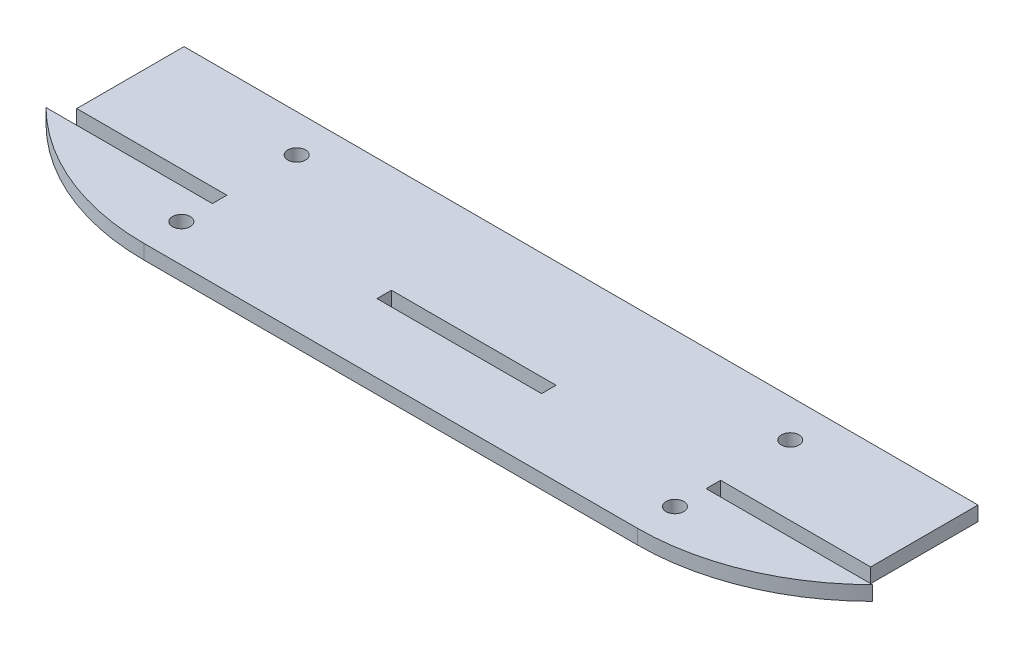
ISO-10303-21;
HEADER;
FILE_DESCRIPTION(('STEP AP214'),'2;1');
FILE_NAME('part.step','',(''),(''),'','','');
FILE_SCHEMA(('AUTOMOTIVE_DESIGN { 1 0 10303 214 1 1 1 1 }'));
ENDSEC;
DATA;
#1=APPLICATION_CONTEXT('core data for automotive mechanical design processes');
#2=APPLICATION_PROTOCOL_DEFINITION('international standard','automotive_design',2000,#1);
#3=PRODUCT_CONTEXT('',#1,'mechanical');
#4=PRODUCT('Part','Part','',(#3));
#5=PRODUCT_RELATED_PRODUCT_CATEGORY('part','',(#4));
#6=PRODUCT_DEFINITION_FORMATION('','',#4);
#7=PRODUCT_DEFINITION_CONTEXT('part definition',#1,'design');
#8=PRODUCT_DEFINITION('design','',#6,#7);
#9=PRODUCT_DEFINITION_SHAPE('','',#8);
#10=(LENGTH_UNIT() NAMED_UNIT(*) SI_UNIT(.MILLI.,.METRE.));
#11=(NAMED_UNIT(*) PLANE_ANGLE_UNIT() SI_UNIT($,.RADIAN.));
#12=(NAMED_UNIT(*) SI_UNIT($,.STERADIAN.) SOLID_ANGLE_UNIT());
#13=UNCERTAINTY_MEASURE_WITH_UNIT(LENGTH_MEASURE(1.E-05),#10,'distance_accuracy_value','');
#14=(GEOMETRIC_REPRESENTATION_CONTEXT(3) GLOBAL_UNCERTAINTY_ASSIGNED_CONTEXT((#13)) GLOBAL_UNIT_ASSIGNED_CONTEXT((#10,
#11,#12)) REPRESENTATION_CONTEXT('',''));
#15=CARTESIAN_POINT('',(0.,0.,0.));
#16=DIRECTION('',(0.,0.,1.));
#17=DIRECTION('',(1.,0.,0.));
#18=AXIS2_PLACEMENT_3D('',#15,#16,#17);
#19=CARTESIAN_POINT('',(-46.,2.7,-44.));
#20=DIRECTION('',(0.,1.,0.));
#21=DIRECTION('',(0.,0.,1.));
#22=AXIS2_PLACEMENT_3D('',#19,#20,#21);
#23=PLANE('',#22);
#24=CARTESIAN_POINT('',(-46.,2.7,-7.));
#25=DIRECTION('',(0.,1.,0.));
#26=DIRECTION('',(0.,0.,1.));
#27=AXIS2_PLACEMENT_3D('',#24,#25,#26);
#28=CIRCLE('',#27,1.65);
#29=CARTESIAN_POINT('',(-46.,2.7,-5.35));
#30=VERTEX_POINT('',#29);
#31=EDGE_CURVE('E531',#30,#30,#28,.T.);
#32=ORIENTED_EDGE('',*,*,#31,.F.);
#33=EDGE_LOOP('',(#32));
#34=FACE_BOUND('',#33,.T.);
#35=DIRECTION('',(0.,0.,1.));
#36=VECTOR('',#35,1.);
#37=CARTESIAN_POINT('',(-15.34,2.7,-15.5));
#38=LINE('',#37,#36);
#39=CARTESIAN_POINT('',(-15.34,2.7,-15.5));
#40=VERTEX_POINT('',#39);
#41=CARTESIAN_POINT('',(-15.34,2.7,-12.8));
#42=VERTEX_POINT('',#41);
#43=EDGE_CURVE('E153',#40,#42,#38,.T.);
#44=ORIENTED_EDGE('',*,*,#43,.F.);
#45=DIRECTION('',(-1.,0.,0.));
#46=VECTOR('',#45,1.);
#47=CARTESIAN_POINT('',(15.34,2.7,-15.5));
#48=LINE('',#47,#46);
#49=CARTESIAN_POINT('',(15.34,2.7,-15.5));
#50=VERTEX_POINT('',#49);
#51=EDGE_CURVE('E145',#50,#40,#48,.T.);
#52=ORIENTED_EDGE('',*,*,#51,.F.);
#53=DIRECTION('',(0.,0.,-1.));
#54=VECTOR('',#53,1.);
#55=CARTESIAN_POINT('',(15.34,2.7,-12.8));
#56=LINE('',#55,#54);
#57=CARTESIAN_POINT('',(15.34,2.7,-12.8));
#58=VERTEX_POINT('',#57);
#59=EDGE_CURVE('E168',#58,#50,#56,.T.);
#60=ORIENTED_EDGE('',*,*,#59,.F.);
#61=DIRECTION('',(1.,0.,0.));
#62=VECTOR('',#61,1.);
#63=CARTESIAN_POINT('',(-15.34,2.7,-12.8));
#64=LINE('',#63,#62);
#65=EDGE_CURVE('E166',#42,#58,#64,.T.);
#66=ORIENTED_EDGE('',*,*,#65,.F.);
#67=EDGE_LOOP('',(#44,#52,#60,#66));
#68=FACE_BOUND('',#67,.T.);
#69=CARTESIAN_POINT('',(46.,2.7,-28.5));
#70=DIRECTION('',(0.,1.,0.));
#71=DIRECTION('',(0.,0.,1.));
#72=AXIS2_PLACEMENT_3D('',#69,#70,#71);
#73=CIRCLE('',#72,1.65);
#74=CARTESIAN_POINT('',(46.,2.7,-26.85));
#75=VERTEX_POINT('',#74);
#76=EDGE_CURVE('E184',#75,#75,#73,.T.);
#77=ORIENTED_EDGE('',*,*,#76,.F.);
#78=EDGE_LOOP('',(#77));
#79=FACE_BOUND('',#78,.T.);
#80=DIRECTION('',(-1.,0.,0.));
#81=VECTOR('',#80,1.);
#82=CARTESIAN_POINT('',(-46.0151510874645,2.7,-12.8));
#83=LINE('',#82,#81);
#84=CARTESIAN_POINT('',(-46.0151510874645,2.7,-12.8));
#85=VERTEX_POINT('',#84);
#86=CARTESIAN_POINT('',(-77.0251510874645,2.7,-12.8));
#87=VERTEX_POINT('',#86);
#88=EDGE_CURVE('E190',#85,#87,#83,.T.);
#89=ORIENTED_EDGE('',*,*,#88,.T.);
#90=CARTESIAN_POINT('',(-46.,2.7,-44.));
#91=DIRECTION('',(0.,1.,0.));
#92=DIRECTION('',(0.,0.,1.));
#93=AXIS2_PLACEMENT_3D('',#90,#91,#92);
#94=CIRCLE('',#93,44.);
#95=CARTESIAN_POINT('',(-46.,2.7,0.));
#96=VERTEX_POINT('',#95);
#97=EDGE_CURVE('E193',#87,#96,#94,.T.);
#98=ORIENTED_EDGE('',*,*,#97,.T.);
#99=DIRECTION('',(1.,0.,0.));
#100=VECTOR('',#99,1.);
#101=CARTESIAN_POINT('',(-46.,2.7,0.));
#102=LINE('',#101,#100);
#103=CARTESIAN_POINT('',(46.,2.7,0.));
#104=VERTEX_POINT('',#103);
#105=EDGE_CURVE('E196',#96,#104,#102,.T.);
#106=ORIENTED_EDGE('',*,*,#105,.T.);
#107=CARTESIAN_POINT('',(46.,2.7,-44.));
#108=DIRECTION('',(0.,1.,0.));
#109=DIRECTION('',(0.,0.,1.));
#110=AXIS2_PLACEMENT_3D('',#107,#108,#109);
#111=CIRCLE('',#110,44.);
#112=CARTESIAN_POINT('',(77.0251510874645,2.7,-12.8));
#113=VERTEX_POINT('',#112);
#114=EDGE_CURVE('E198',#104,#113,#111,.T.);
#115=ORIENTED_EDGE('',*,*,#114,.T.);
#116=DIRECTION('',(-1.,0.,0.));
#117=VECTOR('',#116,1.);
#118=CARTESIAN_POINT('',(77.0251510874645,2.7,-12.8));
#119=LINE('',#118,#117);
#120=CARTESIAN_POINT('',(46.0151510874645,2.7,-12.8));
#121=VERTEX_POINT('',#120);
#122=EDGE_CURVE('E200',#113,#121,#119,.T.);
#123=ORIENTED_EDGE('',*,*,#122,.T.);
#124=DIRECTION('',(0.,0.,-1.));
#125=VECTOR('',#124,1.);
#126=CARTESIAN_POINT('',(46.0151510874645,2.7,-15.5));
#127=LINE('',#126,#125);
#128=CARTESIAN_POINT('',(46.0151510874645,2.7,-15.5));
#129=VERTEX_POINT('',#128);
#130=EDGE_CURVE('E202',#121,#129,#127,.T.);
#131=ORIENTED_EDGE('',*,*,#130,.T.);
#132=DIRECTION('',(1.,0.,0.));
#133=VECTOR('',#132,1.);
#134=CARTESIAN_POINT('',(46.0151510874645,2.7,-15.5));
#135=LINE('',#134,#133);
#136=CARTESIAN_POINT('',(73.9951510874645,2.7,-15.5));
#137=VERTEX_POINT('',#136);
#138=EDGE_CURVE('E204',#129,#137,#135,.T.);
#139=ORIENTED_EDGE('',*,*,#138,.T.);
#140=DIRECTION('',(0.,0.,-1.));
#141=VECTOR('',#140,1.);
#142=CARTESIAN_POINT('',(73.9951510874645,2.7,-35.5));
#143=LINE('',#142,#141);
#144=CARTESIAN_POINT('',(73.9951510874645,2.7,-35.5));
#145=VERTEX_POINT('',#144);
#146=EDGE_CURVE('E206',#137,#145,#143,.T.);
#147=ORIENTED_EDGE('',*,*,#146,.T.);
#148=DIRECTION('',(-1.,0.,0.));
#149=VECTOR('',#148,1.);
#150=CARTESIAN_POINT('',(-73.9951510874645,2.7,-35.5));
#151=LINE('',#150,#149);
#152=CARTESIAN_POINT('',(-73.9951510874645,2.7,-35.5));
#153=VERTEX_POINT('',#152);
#154=EDGE_CURVE('E208',#145,#153,#151,.T.);
#155=ORIENTED_EDGE('',*,*,#154,.T.);
#156=DIRECTION('',(0.,0.,1.));
#157=VECTOR('',#156,1.);
#158=CARTESIAN_POINT('',(-73.9951510874645,2.7,-35.5));
#159=LINE('',#158,#157);
#160=CARTESIAN_POINT('',(-73.9951510874645,2.7,-15.5));
#161=VERTEX_POINT('',#160);
#162=EDGE_CURVE('E210',#153,#161,#159,.T.);
#163=ORIENTED_EDGE('',*,*,#162,.T.);
#164=DIRECTION('',(1.,0.,0.));
#165=VECTOR('',#164,1.);
#166=CARTESIAN_POINT('',(-46.0151510874645,2.7,-15.5));
#167=LINE('',#166,#165);
#168=CARTESIAN_POINT('',(-46.0151510874645,2.7,-15.5));
#169=VERTEX_POINT('',#168);
#170=EDGE_CURVE('E212',#161,#169,#167,.T.);
#171=ORIENTED_EDGE('',*,*,#170,.T.);
#172=DIRECTION('',(0.,0.,1.));
#173=VECTOR('',#172,1.);
#174=CARTESIAN_POINT('',(-46.0151510874645,2.7,-15.5));
#175=LINE('',#174,#173);
#176=EDGE_CURVE('E214',#169,#85,#175,.T.);
#177=ORIENTED_EDGE('',*,*,#176,.T.);
#178=EDGE_LOOP('',(#89,#98,#106,#115,#123,#131,#139,#147,#155,#163,#171,#177));
#179=FACE_BOUND('',#178,.T.);
#180=CARTESIAN_POINT('',(46.,2.7,-7.));
#181=DIRECTION('',(0.,1.,0.));
#182=DIRECTION('',(0.,0.,1.));
#183=AXIS2_PLACEMENT_3D('',#180,#181,#182);
#184=CIRCLE('',#183,1.65);
#185=CARTESIAN_POINT('',(46.,2.7,-5.35));
#186=VERTEX_POINT('',#185);
#187=EDGE_CURVE('E174',#186,#186,#184,.T.);
#188=ORIENTED_EDGE('',*,*,#187,.F.);
#189=EDGE_LOOP('',(#188));
#190=FACE_BOUND('',#189,.T.);
#191=CARTESIAN_POINT('',(-46.,2.7,-28.5));
#192=DIRECTION('',(0.,1.,0.));
#193=DIRECTION('',(0.,0.,1.));
#194=AXIS2_PLACEMENT_3D('',#191,#192,#193);
#195=CIRCLE('',#194,1.65);
#196=CARTESIAN_POINT('',(-46.,2.7,-26.85));
#197=VERTEX_POINT('',#196);
#198=EDGE_CURVE('E522',#197,#197,#195,.T.);
#199=ORIENTED_EDGE('',*,*,#198,.F.);
#200=EDGE_LOOP('',(#199));
#201=FACE_BOUND('',#200,.T.);
#202=ADVANCED_FACE('F32',(#34,#68,#79,#179,#190,#201),#23,.T.);
#203=CARTESIAN_POINT('',(-46.,0.,-44.));
#204=DIRECTION('',(0.,1.,0.));
#205=DIRECTION('',(0.,0.,1.));
#206=AXIS2_PLACEMENT_3D('',#203,#204,#205);
#207=PLANE('',#206);
#208=CARTESIAN_POINT('',(46.,0.,-28.5));
#209=DIRECTION('',(0.,1.,0.));
#210=DIRECTION('',(0.,0.,1.));
#211=AXIS2_PLACEMENT_3D('',#208,#209,#210);
#212=CIRCLE('',#211,1.65);
#213=CARTESIAN_POINT('',(46.,0.,-26.85));
#214=VERTEX_POINT('',#213);
#215=EDGE_CURVE('E161',#214,#214,#212,.T.);
#216=ORIENTED_EDGE('',*,*,#215,.T.);
#217=EDGE_LOOP('',(#216));
#218=FACE_BOUND('',#217,.T.);
#219=DIRECTION('',(-1.,0.,0.));
#220=VECTOR('',#219,1.);
#221=CARTESIAN_POINT('',(-46.0151510874645,0.,-12.8));
#222=LINE('',#221,#220);
#223=CARTESIAN_POINT('',(-46.0151510874645,0.,-12.8));
#224=VERTEX_POINT('',#223);
#225=CARTESIAN_POINT('',(-77.0251510874645,0.,-12.8));
#226=VERTEX_POINT('',#225);
#227=EDGE_CURVE('E187',#224,#226,#222,.T.);
#228=ORIENTED_EDGE('',*,*,#227,.F.);
#229=DIRECTION('',(0.,0.,1.));
#230=VECTOR('',#229,1.);
#231=CARTESIAN_POINT('',(-46.0151510874645,0.,-15.5));
#232=LINE('',#231,#230);
#233=CARTESIAN_POINT('',(-46.0151510874645,0.,-15.5));
#234=VERTEX_POINT('',#233);
#235=EDGE_CURVE('E194',#234,#224,#232,.T.);
#236=ORIENTED_EDGE('',*,*,#235,.F.);
#237=DIRECTION('',(1.,0.,0.));
#238=VECTOR('',#237,1.);
#239=CARTESIAN_POINT('',(-46.0151510874645,0.,-15.5));
#240=LINE('',#239,#238);
#241=CARTESIAN_POINT('',(-73.9951510874645,0.,-15.5));
#242=VERTEX_POINT('',#241);
#243=EDGE_CURVE('E237',#242,#234,#240,.T.);
#244=ORIENTED_EDGE('',*,*,#243,.F.);
#245=DIRECTION('',(0.,0.,1.));
#246=VECTOR('',#245,1.);
#247=CARTESIAN_POINT('',(-73.9951510874645,0.,-35.5));
#248=LINE('',#247,#246);
#249=CARTESIAN_POINT('',(-73.9951510874645,0.,-35.5));
#250=VERTEX_POINT('',#249);
#251=EDGE_CURVE('E235',#250,#242,#248,.T.);
#252=ORIENTED_EDGE('',*,*,#251,.F.);
#253=DIRECTION('',(-1.,0.,0.));
#254=VECTOR('',#253,1.);
#255=CARTESIAN_POINT('',(-73.9951510874645,0.,-35.5));
#256=LINE('',#255,#254);
#257=CARTESIAN_POINT('',(73.9951510874645,0.,-35.5));
#258=VERTEX_POINT('',#257);
#259=EDGE_CURVE('E233',#258,#250,#256,.T.);
#260=ORIENTED_EDGE('',*,*,#259,.F.);
#261=DIRECTION('',(0.,0.,-1.));
#262=VECTOR('',#261,1.);
#263=CARTESIAN_POINT('',(73.9951510874645,0.,-35.5));
#264=LINE('',#263,#262);
#265=CARTESIAN_POINT('',(73.9951510874645,0.,-15.5));
#266=VERTEX_POINT('',#265);
#267=EDGE_CURVE('E231',#266,#258,#264,.T.);
#268=ORIENTED_EDGE('',*,*,#267,.F.);
#269=DIRECTION('',(1.,0.,0.));
#270=VECTOR('',#269,1.);
#271=CARTESIAN_POINT('',(46.0151510874645,0.,-15.5));
#272=LINE('',#271,#270);
#273=CARTESIAN_POINT('',(46.0151510874645,0.,-15.5));
#274=VERTEX_POINT('',#273);
#275=EDGE_CURVE('E229',#274,#266,#272,.T.);
#276=ORIENTED_EDGE('',*,*,#275,.F.);
#277=DIRECTION('',(0.,0.,-1.));
#278=VECTOR('',#277,1.);
#279=CARTESIAN_POINT('',(46.0151510874645,0.,-15.5));
#280=LINE('',#279,#278);
#281=CARTESIAN_POINT('',(46.0151510874645,0.,-12.8));
#282=VERTEX_POINT('',#281);
#283=EDGE_CURVE('E227',#282,#274,#280,.T.);
#284=ORIENTED_EDGE('',*,*,#283,.F.);
#285=DIRECTION('',(-1.,0.,0.));
#286=VECTOR('',#285,1.);
#287=CARTESIAN_POINT('',(77.0251510874645,0.,-12.8));
#288=LINE('',#287,#286);
#289=CARTESIAN_POINT('',(77.0251510874645,0.,-12.8));
#290=VERTEX_POINT('',#289);
#291=EDGE_CURVE('E225',#290,#282,#288,.T.);
#292=ORIENTED_EDGE('',*,*,#291,.F.);
#293=CARTESIAN_POINT('',(46.,0.,-44.));
#294=DIRECTION('',(0.,1.,0.));
#295=DIRECTION('',(0.,0.,1.));
#296=AXIS2_PLACEMENT_3D('',#293,#294,#295);
#297=CIRCLE('',#296,44.);
#298=CARTESIAN_POINT('',(46.,0.,0.));
#299=VERTEX_POINT('',#298);
#300=EDGE_CURVE('E223',#299,#290,#297,.T.);
#301=ORIENTED_EDGE('',*,*,#300,.F.);
#302=DIRECTION('',(1.,0.,0.));
#303=VECTOR('',#302,1.);
#304=CARTESIAN_POINT('',(-46.,0.,0.));
#305=LINE('',#304,#303);
#306=CARTESIAN_POINT('',(-46.,0.,0.));
#307=VERTEX_POINT('',#306);
#308=EDGE_CURVE('E221',#307,#299,#305,.T.);
#309=ORIENTED_EDGE('',*,*,#308,.F.);
#310=CARTESIAN_POINT('',(-46.,0.,-44.));
#311=DIRECTION('',(0.,1.,0.));
#312=DIRECTION('',(0.,0.,1.));
#313=AXIS2_PLACEMENT_3D('',#310,#311,#312);
#314=CIRCLE('',#313,44.);
#315=EDGE_CURVE('E219',#226,#307,#314,.T.);
#316=ORIENTED_EDGE('',*,*,#315,.F.);
#317=EDGE_LOOP('',(#228,#236,#244,#252,#260,#268,#276,#284,#292,#301,#309,#316));
#318=FACE_BOUND('',#317,.T.);
#319=DIRECTION('',(-1.,0.,0.));
#320=VECTOR('',#319,1.);
#321=CARTESIAN_POINT('',(15.34,0.,-15.5));
#322=LINE('',#321,#320);
#323=CARTESIAN_POINT('',(15.34,0.,-15.5));
#324=VERTEX_POINT('',#323);
#325=CARTESIAN_POINT('',(-15.34,0.,-15.5));
#326=VERTEX_POINT('',#325);
#327=EDGE_CURVE('E55',#324,#326,#322,.T.);
#328=ORIENTED_EDGE('',*,*,#327,.T.);
#329=DIRECTION('',(0.,0.,1.));
#330=VECTOR('',#329,1.);
#331=CARTESIAN_POINT('',(-15.34,0.,-15.5));
#332=LINE('',#331,#330);
#333=CARTESIAN_POINT('',(-15.34,0.,-12.8));
#334=VERTEX_POINT('',#333);
#335=EDGE_CURVE('E160',#326,#334,#332,.T.);
#336=ORIENTED_EDGE('',*,*,#335,.T.);
#337=DIRECTION('',(1.,0.,0.));
#338=VECTOR('',#337,1.);
#339=CARTESIAN_POINT('',(-15.34,0.,-12.8));
#340=LINE('',#339,#338);
#341=CARTESIAN_POINT('',(15.34,0.,-12.8));
#342=VERTEX_POINT('',#341);
#343=EDGE_CURVE('E176',#334,#342,#340,.T.);
#344=ORIENTED_EDGE('',*,*,#343,.T.);
#345=DIRECTION('',(0.,0.,-1.));
#346=VECTOR('',#345,1.);
#347=CARTESIAN_POINT('',(15.34,0.,-12.8));
#348=LINE('',#347,#346);
#349=EDGE_CURVE('E154',#342,#324,#348,.T.);
#350=ORIENTED_EDGE('',*,*,#349,.T.);
#351=EDGE_LOOP('',(#328,#336,#344,#350));
#352=FACE_BOUND('',#351,.T.);
#353=CARTESIAN_POINT('',(46.,0.,-7.));
#354=DIRECTION('',(0.,1.,0.));
#355=DIRECTION('',(0.,0.,1.));
#356=AXIS2_PLACEMENT_3D('',#353,#354,#355);
#357=CIRCLE('',#356,1.65);
#358=CARTESIAN_POINT('',(46.,0.,-5.35));
#359=VERTEX_POINT('',#358);
#360=EDGE_CURVE('E534',#359,#359,#357,.T.);
#361=ORIENTED_EDGE('',*,*,#360,.T.);
#362=EDGE_LOOP('',(#361));
#363=FACE_BOUND('',#362,.T.);
#364=CARTESIAN_POINT('',(-46.,0.,-7.));
#365=DIRECTION('',(0.,1.,0.));
#366=DIRECTION('',(0.,0.,1.));
#367=AXIS2_PLACEMENT_3D('',#364,#365,#366);
#368=CIRCLE('',#367,1.65);
#369=CARTESIAN_POINT('',(-46.,0.,-5.35));
#370=VERTEX_POINT('',#369);
#371=EDGE_CURVE('E528',#370,#370,#368,.T.);
#372=ORIENTED_EDGE('',*,*,#371,.T.);
#373=EDGE_LOOP('',(#372));
#374=FACE_BOUND('',#373,.T.);
#375=CARTESIAN_POINT('',(-46.,0.,-28.5));
#376=DIRECTION('',(0.,1.,0.));
#377=DIRECTION('',(0.,0.,1.));
#378=AXIS2_PLACEMENT_3D('',#375,#376,#377);
#379=CIRCLE('',#378,1.65);
#380=CARTESIAN_POINT('',(-46.,0.,-26.85));
#381=VERTEX_POINT('',#380);
#382=EDGE_CURVE('E525',#381,#381,#379,.T.);
#383=ORIENTED_EDGE('',*,*,#382,.T.);
#384=EDGE_LOOP('',(#383));
#385=FACE_BOUND('',#384,.T.);
#386=ADVANCED_FACE('F279',(#218,#318,#352,#363,#374,#385),#207,.F.);
#387=CARTESIAN_POINT('',(-46.0151510874645,2.7,-12.8));
#388=DIRECTION('',(0.,0.,1.));
#389=DIRECTION('',(1.,0.,0.));
#390=AXIS2_PLACEMENT_3D('',#387,#388,#389);
#391=PLANE('',#390);
#392=ORIENTED_EDGE('',*,*,#227,.T.);
#393=DIRECTION('',(0.,-1.,0.));
#394=VECTOR('',#393,1.);
#395=CARTESIAN_POINT('',(-77.0251510874645,2.7,-12.8));
#396=LINE('',#395,#394);
#397=EDGE_CURVE('E11',#87,#226,#396,.T.);
#398=ORIENTED_EDGE('',*,*,#397,.F.);
#399=ORIENTED_EDGE('',*,*,#88,.F.);
#400=DIRECTION('',(0.,-1.,0.));
#401=VECTOR('',#400,1.);
#402=CARTESIAN_POINT('',(-46.0151510874645,2.7,-12.8));
#403=LINE('',#402,#401);
#404=EDGE_CURVE('E216',#85,#224,#403,.T.);
#405=ORIENTED_EDGE('',*,*,#404,.T.);
#406=EDGE_LOOP('',(#392,#398,#399,#405));
#407=FACE_BOUND('',#406,.T.);
#408=ADVANCED_FACE('F34',(#407),#391,.F.);
#409=CARTESIAN_POINT('',(-46.,2.7,-44.));
#410=DIRECTION('',(0.,-1.,0.));
#411=DIRECTION('',(0.,0.,-1.));
#412=AXIS2_PLACEMENT_3D('',#409,#410,#411);
#413=CYLINDRICAL_SURFACE('',#412,44.);
#414=ORIENTED_EDGE('',*,*,#315,.T.);
#415=DIRECTION('',(0.,-1.,0.));
#416=VECTOR('',#415,1.);
#417=CARTESIAN_POINT('',(-46.,2.7,0.));
#418=LINE('',#417,#416);
#419=EDGE_CURVE('E40',#96,#307,#418,.T.);
#420=ORIENTED_EDGE('',*,*,#419,.F.);
#421=ORIENTED_EDGE('',*,*,#97,.F.);
#422=ORIENTED_EDGE('',*,*,#397,.T.);
#423=EDGE_LOOP('',(#414,#420,#421,#422));
#424=FACE_BOUND('',#423,.T.);
#425=ADVANCED_FACE('F297',(#424),#413,.T.);
#426=CARTESIAN_POINT('',(-46.,2.7,0.));
#427=DIRECTION('',(0.,0.,-1.));
#428=DIRECTION('',(-1.,0.,0.));
#429=AXIS2_PLACEMENT_3D('',#426,#427,#428);
#430=PLANE('',#429);
#431=ORIENTED_EDGE('',*,*,#308,.T.);
#432=DIRECTION('',(0.,-1.,0.));
#433=VECTOR('',#432,1.);
#434=CARTESIAN_POINT('',(46.,2.7,0.));
#435=LINE('',#434,#433);
#436=EDGE_CURVE('E266',#104,#299,#435,.T.);
#437=ORIENTED_EDGE('',*,*,#436,.F.);
#438=ORIENTED_EDGE('',*,*,#105,.F.);
#439=ORIENTED_EDGE('',*,*,#419,.T.);
#440=EDGE_LOOP('',(#431,#437,#438,#439));
#441=FACE_BOUND('',#440,.T.);
#442=ADVANCED_FACE('F273',(#441),#430,.F.);
#443=CARTESIAN_POINT('',(46.,2.7,-44.));
#444=DIRECTION('',(0.,-1.,0.));
#445=DIRECTION('',(0.,0.,-1.));
#446=AXIS2_PLACEMENT_3D('',#443,#444,#445);
#447=CYLINDRICAL_SURFACE('',#446,44.);
#448=ORIENTED_EDGE('',*,*,#300,.T.);
#449=DIRECTION('',(0.,-1.,0.));
#450=VECTOR('',#449,1.);
#451=CARTESIAN_POINT('',(77.0251510874645,2.7,-12.8));
#452=LINE('',#451,#450);
#453=EDGE_CURVE('E263',#113,#290,#452,.T.);
#454=ORIENTED_EDGE('',*,*,#453,.F.);
#455=ORIENTED_EDGE('',*,*,#114,.F.);
#456=ORIENTED_EDGE('',*,*,#436,.T.);
#457=EDGE_LOOP('',(#448,#454,#455,#456));
#458=FACE_BOUND('',#457,.T.);
#459=ADVANCED_FACE('F285',(#458),#447,.T.);
#460=CARTESIAN_POINT('',(77.0251510874645,2.7,-12.8));
#461=DIRECTION('',(0.,0.,1.));
#462=DIRECTION('',(1.,0.,0.));
#463=AXIS2_PLACEMENT_3D('',#460,#461,#462);
#464=PLANE('',#463);
#465=ORIENTED_EDGE('',*,*,#291,.T.);
#466=DIRECTION('',(0.,-1.,0.));
#467=VECTOR('',#466,1.);
#468=CARTESIAN_POINT('',(46.0151510874645,2.7,-12.8));
#469=LINE('',#468,#467);
#470=EDGE_CURVE('E260',#121,#282,#469,.T.);
#471=ORIENTED_EDGE('',*,*,#470,.F.);
#472=ORIENTED_EDGE('',*,*,#122,.F.);
#473=ORIENTED_EDGE('',*,*,#453,.T.);
#474=EDGE_LOOP('',(#465,#471,#472,#473));
#475=FACE_BOUND('',#474,.T.);
#476=ADVANCED_FACE('F289',(#475),#464,.F.);
#477=CARTESIAN_POINT('',(46.0151510874645,2.7,-15.5));
#478=DIRECTION('',(-1.,0.,0.));
#479=DIRECTION('',(0.,0.,1.));
#480=AXIS2_PLACEMENT_3D('',#477,#478,#479);
#481=PLANE('',#480);
#482=ORIENTED_EDGE('',*,*,#283,.T.);
#483=DIRECTION('',(0.,-1.,0.));
#484=VECTOR('',#483,1.);
#485=CARTESIAN_POINT('',(46.0151510874645,2.7,-15.5));
#486=LINE('',#485,#484);
#487=EDGE_CURVE('E257',#129,#274,#486,.T.);
#488=ORIENTED_EDGE('',*,*,#487,.F.);
#489=ORIENTED_EDGE('',*,*,#130,.F.);
#490=ORIENTED_EDGE('',*,*,#470,.T.);
#491=EDGE_LOOP('',(#482,#488,#489,#490));
#492=FACE_BOUND('',#491,.T.);
#493=ADVANCED_FACE('F330',(#492),#481,.F.);
#494=CARTESIAN_POINT('',(46.0151510874645,2.7,-15.5));
#495=DIRECTION('',(0.,0.,-1.));
#496=DIRECTION('',(-1.,0.,0.));
#497=AXIS2_PLACEMENT_3D('',#494,#495,#496);
#498=PLANE('',#497);
#499=ORIENTED_EDGE('',*,*,#275,.T.);
#500=DIRECTION('',(0.,-1.,0.));
#501=VECTOR('',#500,1.);
#502=CARTESIAN_POINT('',(73.9951510874645,2.7,-15.5));
#503=LINE('',#502,#501);
#504=EDGE_CURVE('E254',#137,#266,#503,.T.);
#505=ORIENTED_EDGE('',*,*,#504,.F.);
#506=ORIENTED_EDGE('',*,*,#138,.F.);
#507=ORIENTED_EDGE('',*,*,#487,.T.);
#508=EDGE_LOOP('',(#499,#505,#506,#507));
#509=FACE_BOUND('',#508,.T.);
#510=ADVANCED_FACE('F328',(#509),#498,.F.);
#511=CARTESIAN_POINT('',(73.9951510874645,2.7,-35.5));
#512=DIRECTION('',(-1.,0.,0.));
#513=DIRECTION('',(0.,0.,1.));
#514=AXIS2_PLACEMENT_3D('',#511,#512,#513);
#515=PLANE('',#514);
#516=ORIENTED_EDGE('',*,*,#267,.T.);
#517=DIRECTION('',(0.,-1.,0.));
#518=VECTOR('',#517,1.);
#519=CARTESIAN_POINT('',(73.9951510874645,2.7,-35.5));
#520=LINE('',#519,#518);
#521=EDGE_CURVE('E251',#145,#258,#520,.T.);
#522=ORIENTED_EDGE('',*,*,#521,.F.);
#523=ORIENTED_EDGE('',*,*,#146,.F.);
#524=ORIENTED_EDGE('',*,*,#504,.T.);
#525=EDGE_LOOP('',(#516,#522,#523,#524));
#526=FACE_BOUND('',#525,.T.);
#527=ADVANCED_FACE('F324',(#526),#515,.F.);
#528=CARTESIAN_POINT('',(-73.9951510874645,2.7,-35.5));
#529=DIRECTION('',(0.,0.,1.));
#530=DIRECTION('',(1.,0.,0.));
#531=AXIS2_PLACEMENT_3D('',#528,#529,#530);
#532=PLANE('',#531);
#533=ORIENTED_EDGE('',*,*,#259,.T.);
#534=DIRECTION('',(0.,-1.,0.));
#535=VECTOR('',#534,1.);
#536=CARTESIAN_POINT('',(-73.9951510874645,2.7,-35.5));
#537=LINE('',#536,#535);
#538=EDGE_CURVE('E248',#153,#250,#537,.T.);
#539=ORIENTED_EDGE('',*,*,#538,.F.);
#540=ORIENTED_EDGE('',*,*,#154,.F.);
#541=ORIENTED_EDGE('',*,*,#521,.T.);
#542=EDGE_LOOP('',(#533,#539,#540,#541));
#543=FACE_BOUND('',#542,.T.);
#544=ADVANCED_FACE('F319',(#543),#532,.F.);
#545=CARTESIAN_POINT('',(-73.9951510874645,2.7,-35.5));
#546=DIRECTION('',(1.,0.,0.));
#547=DIRECTION('',(0.,0.,-1.));
#548=AXIS2_PLACEMENT_3D('',#545,#546,#547);
#549=PLANE('',#548);
#550=ORIENTED_EDGE('',*,*,#251,.T.);
#551=DIRECTION('',(0.,-1.,0.));
#552=VECTOR('',#551,1.);
#553=CARTESIAN_POINT('',(-73.9951510874645,2.7,-15.5));
#554=LINE('',#553,#552);
#555=EDGE_CURVE('E245',#161,#242,#554,.T.);
#556=ORIENTED_EDGE('',*,*,#555,.F.);
#557=ORIENTED_EDGE('',*,*,#162,.F.);
#558=ORIENTED_EDGE('',*,*,#538,.T.);
#559=EDGE_LOOP('',(#550,#556,#557,#558));
#560=FACE_BOUND('',#559,.T.);
#561=ADVANCED_FACE('F313',(#560),#549,.F.);
#562=CARTESIAN_POINT('',(-46.0151510874645,2.7,-15.5));
#563=DIRECTION('',(0.,0.,-1.));
#564=DIRECTION('',(-1.,0.,0.));
#565=AXIS2_PLACEMENT_3D('',#562,#563,#564);
#566=PLANE('',#565);
#567=ORIENTED_EDGE('',*,*,#243,.T.);
#568=DIRECTION('',(0.,-1.,0.));
#569=VECTOR('',#568,1.);
#570=CARTESIAN_POINT('',(-46.0151510874645,2.7,-15.5));
#571=LINE('',#570,#569);
#572=EDGE_CURVE('E242',#169,#234,#571,.T.);
#573=ORIENTED_EDGE('',*,*,#572,.F.);
#574=ORIENTED_EDGE('',*,*,#170,.F.);
#575=ORIENTED_EDGE('',*,*,#555,.T.);
#576=EDGE_LOOP('',(#567,#573,#574,#575));
#577=FACE_BOUND('',#576,.T.);
#578=ADVANCED_FACE('F309',(#577),#566,.F.);
#579=CARTESIAN_POINT('',(-46.0151510874645,2.7,-15.5));
#580=DIRECTION('',(1.,0.,0.));
#581=DIRECTION('',(0.,0.,-1.));
#582=AXIS2_PLACEMENT_3D('',#579,#580,#581);
#583=PLANE('',#582);
#584=ORIENTED_EDGE('',*,*,#235,.T.);
#585=ORIENTED_EDGE('',*,*,#404,.F.);
#586=ORIENTED_EDGE('',*,*,#176,.F.);
#587=ORIENTED_EDGE('',*,*,#572,.T.);
#588=EDGE_LOOP('',(#584,#585,#586,#587));
#589=FACE_BOUND('',#588,.T.);
#590=ADVANCED_FACE('F304',(#589),#583,.F.);
#591=CARTESIAN_POINT('',(46.,2.7,-28.5));
#592=DIRECTION('',(0.,-1.,0.));
#593=DIRECTION('',(0.,0.,-1.));
#594=AXIS2_PLACEMENT_3D('',#591,#592,#593);
#595=CYLINDRICAL_SURFACE('',#594,1.65);
#596=ORIENTED_EDGE('',*,*,#76,.T.);
#597=EDGE_LOOP('',(#596));
#598=FACE_BOUND('',#597,.T.);
#599=ORIENTED_EDGE('',*,*,#215,.F.);
#600=EDGE_LOOP('',(#599));
#601=FACE_BOUND('',#600,.T.);
#602=ADVANCED_FACE('F349',(#598,#601),#595,.F.);
#603=CARTESIAN_POINT('',(15.34,2.7,-15.5));
#604=DIRECTION('',(0.,0.,1.));
#605=DIRECTION('',(1.,0.,0.));
#606=AXIS2_PLACEMENT_3D('',#603,#604,#605);
#607=PLANE('',#606);
#608=ORIENTED_EDGE('',*,*,#327,.F.);
#609=DIRECTION('',(0.,-1.,0.));
#610=VECTOR('',#609,1.);
#611=CARTESIAN_POINT('',(15.34,2.7,-15.5));
#612=LINE('',#611,#610);
#613=EDGE_CURVE('E149',#50,#324,#612,.T.);
#614=ORIENTED_EDGE('',*,*,#613,.F.);
#615=ORIENTED_EDGE('',*,*,#51,.T.);
#616=DIRECTION('',(0.,-1.,0.));
#617=VECTOR('',#616,1.);
#618=CARTESIAN_POINT('',(-15.34,2.7,-15.5));
#619=LINE('',#618,#617);
#620=EDGE_CURVE('E148',#40,#326,#619,.T.);
#621=ORIENTED_EDGE('',*,*,#620,.T.);
#622=EDGE_LOOP('',(#608,#614,#615,#621));
#623=FACE_BOUND('',#622,.T.);
#624=ADVANCED_FACE('F147',(#623),#607,.T.);
#625=CARTESIAN_POINT('',(-15.34,2.7,-15.5));
#626=DIRECTION('',(1.,0.,0.));
#627=DIRECTION('',(0.,0.,-1.));
#628=AXIS2_PLACEMENT_3D('',#625,#626,#627);
#629=PLANE('',#628);
#630=ORIENTED_EDGE('',*,*,#335,.F.);
#631=ORIENTED_EDGE('',*,*,#620,.F.);
#632=ORIENTED_EDGE('',*,*,#43,.T.);
#633=DIRECTION('',(0.,-1.,0.));
#634=VECTOR('',#633,1.);
#635=CARTESIAN_POINT('',(-15.34,2.7,-12.8));
#636=LINE('',#635,#634);
#637=EDGE_CURVE('E162',#42,#334,#636,.T.);
#638=ORIENTED_EDGE('',*,*,#637,.T.);
#639=EDGE_LOOP('',(#630,#631,#632,#638));
#640=FACE_BOUND('',#639,.T.);
#641=ADVANCED_FACE('F157',(#640),#629,.T.);
#642=CARTESIAN_POINT('',(-15.34,2.7,-12.8));
#643=DIRECTION('',(0.,0.,-1.));
#644=DIRECTION('',(-1.,0.,0.));
#645=AXIS2_PLACEMENT_3D('',#642,#643,#644);
#646=PLANE('',#645);
#647=ORIENTED_EDGE('',*,*,#343,.F.);
#648=ORIENTED_EDGE('',*,*,#637,.F.);
#649=ORIENTED_EDGE('',*,*,#65,.T.);
#650=DIRECTION('',(0.,-1.,0.));
#651=VECTOR('',#650,1.);
#652=CARTESIAN_POINT('',(15.34,2.7,-12.8));
#653=LINE('',#652,#651);
#654=EDGE_CURVE('E47',#58,#342,#653,.T.);
#655=ORIENTED_EDGE('',*,*,#654,.T.);
#656=EDGE_LOOP('',(#647,#648,#649,#655));
#657=FACE_BOUND('',#656,.T.);
#658=ADVANCED_FACE('F398',(#657),#646,.T.);
#659=CARTESIAN_POINT('',(15.34,2.7,-12.8));
#660=DIRECTION('',(-1.,0.,0.));
#661=DIRECTION('',(0.,0.,1.));
#662=AXIS2_PLACEMENT_3D('',#659,#660,#661);
#663=PLANE('',#662);
#664=ORIENTED_EDGE('',*,*,#349,.F.);
#665=ORIENTED_EDGE('',*,*,#654,.F.);
#666=ORIENTED_EDGE('',*,*,#59,.T.);
#667=ORIENTED_EDGE('',*,*,#613,.T.);
#668=EDGE_LOOP('',(#664,#665,#666,#667));
#669=FACE_BOUND('',#668,.T.);
#670=ADVANCED_FACE('F405',(#669),#663,.T.);
#671=CARTESIAN_POINT('',(46.,2.7,-7.));
#672=DIRECTION('',(0.,-1.,0.));
#673=DIRECTION('',(0.,0.,-1.));
#674=AXIS2_PLACEMENT_3D('',#671,#672,#673);
#675=CYLINDRICAL_SURFACE('',#674,1.65);
#676=ORIENTED_EDGE('',*,*,#187,.T.);
#677=EDGE_LOOP('',(#676));
#678=FACE_BOUND('',#677,.T.);
#679=ORIENTED_EDGE('',*,*,#360,.F.);
#680=EDGE_LOOP('',(#679));
#681=FACE_BOUND('',#680,.T.);
#682=ADVANCED_FACE('F413',(#678,#681),#675,.F.);
#683=CARTESIAN_POINT('',(-46.,2.7,-7.));
#684=DIRECTION('',(0.,-1.,0.));
#685=DIRECTION('',(0.,0.,-1.));
#686=AXIS2_PLACEMENT_3D('',#683,#684,#685);
#687=CYLINDRICAL_SURFACE('',#686,1.65);
#688=ORIENTED_EDGE('',*,*,#31,.T.);
#689=EDGE_LOOP('',(#688));
#690=FACE_BOUND('',#689,.T.);
#691=ORIENTED_EDGE('',*,*,#371,.F.);
#692=EDGE_LOOP('',(#691));
#693=FACE_BOUND('',#692,.T.);
#694=ADVANCED_FACE('F420',(#690,#693),#687,.F.);
#695=CARTESIAN_POINT('',(-46.,2.7,-28.5));
#696=DIRECTION('',(0.,-1.,0.));
#697=DIRECTION('',(0.,0.,-1.));
#698=AXIS2_PLACEMENT_3D('',#695,#696,#697);
#699=CYLINDRICAL_SURFACE('',#698,1.65);
#700=ORIENTED_EDGE('',*,*,#198,.T.);
#701=EDGE_LOOP('',(#700));
#702=FACE_BOUND('',#701,.T.);
#703=ORIENTED_EDGE('',*,*,#382,.F.);
#704=EDGE_LOOP('',(#703));
#705=FACE_BOUND('',#704,.T.);
#706=ADVANCED_FACE('F428',(#702,#705),#699,.F.);
#707=CLOSED_SHELL('',(#202,#386,#408,#425,#442,#459,#476,#493,#510,#527,#544,#561,#578,#590,
#602,#624,#641,#658,#670,#682,#694,#706));
#708=MANIFOLD_SOLID_BREP('B2',#707);
#709=ADVANCED_BREP_SHAPE_REPRESENTATION('',(#18,#708),#14);
#710=SHAPE_DEFINITION_REPRESENTATION(#9,#709);
ENDSEC;
END-ISO-10303-21;
